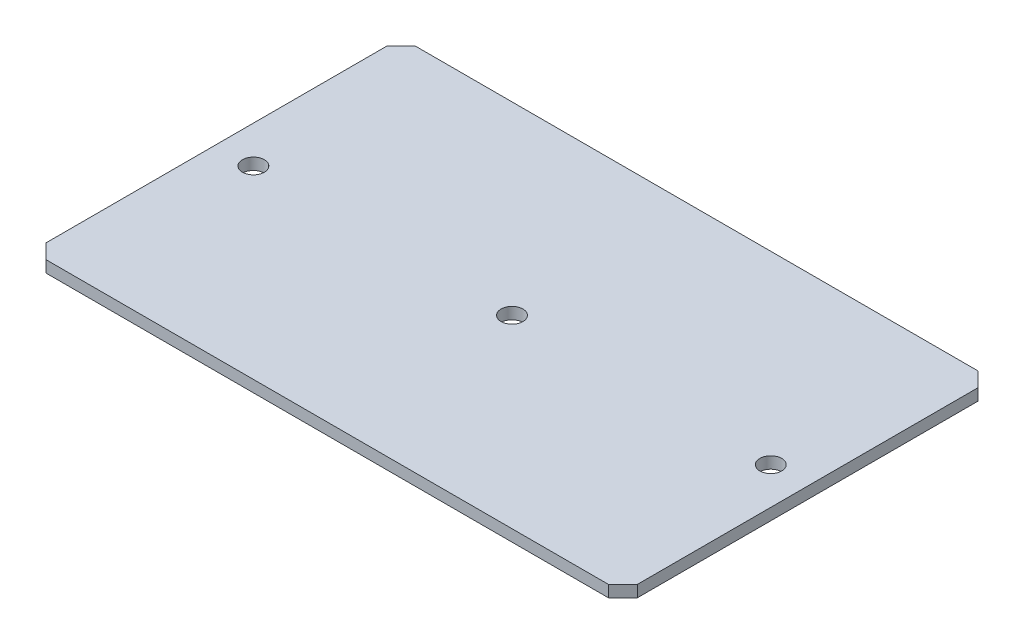
ISO-10303-21;
HEADER;
FILE_DESCRIPTION(('STEP AP214'),'2;1');
FILE_NAME('part.step','',(''),(''),'','','');
FILE_SCHEMA(('AUTOMOTIVE_DESIGN { 1 0 10303 214 1 1 1 1 }'));
ENDSEC;
DATA;
#1=APPLICATION_CONTEXT('core data for automotive mechanical design processes');
#2=APPLICATION_PROTOCOL_DEFINITION('international standard','automotive_design',2000,#1);
#3=PRODUCT_CONTEXT('',#1,'mechanical');
#4=PRODUCT('Part','Part','',(#3));
#5=PRODUCT_RELATED_PRODUCT_CATEGORY('part','',(#4));
#6=PRODUCT_DEFINITION_FORMATION('','',#4);
#7=PRODUCT_DEFINITION_CONTEXT('part definition',#1,'design');
#8=PRODUCT_DEFINITION('design','',#6,#7);
#9=PRODUCT_DEFINITION_SHAPE('','',#8);
#10=(LENGTH_UNIT() NAMED_UNIT(*) SI_UNIT(.MILLI.,.METRE.));
#11=(NAMED_UNIT(*) PLANE_ANGLE_UNIT() SI_UNIT($,.RADIAN.));
#12=(NAMED_UNIT(*) SI_UNIT($,.STERADIAN.) SOLID_ANGLE_UNIT());
#13=UNCERTAINTY_MEASURE_WITH_UNIT(LENGTH_MEASURE(1.E-05),#10,'distance_accuracy_value','');
#14=(GEOMETRIC_REPRESENTATION_CONTEXT(3) GLOBAL_UNCERTAINTY_ASSIGNED_CONTEXT((#13)) GLOBAL_UNIT_ASSIGNED_CONTEXT((#10,
#11,#12)) REPRESENTATION_CONTEXT('',''));
#15=CARTESIAN_POINT('',(0.,0.,0.));
#16=DIRECTION('',(0.,0.,1.));
#17=DIRECTION('',(1.,0.,0.));
#18=AXIS2_PLACEMENT_3D('',#15,#16,#17);
#19=CARTESIAN_POINT('',(40.64,1.6002,-25.4));
#20=DIRECTION('',(-1.,0.,0.));
#21=DIRECTION('',(0.,0.,1.));
#22=AXIS2_PLACEMENT_3D('',#19,#20,#21);
#23=PLANE('',#22);
#24=DIRECTION('',(0.,0.,-1.));
#25=VECTOR('',#24,1.);
#26=CARTESIAN_POINT('',(40.64,1.6002,-25.4));
#27=LINE('',#26,#25);
#28=CARTESIAN_POINT('',(40.64,1.6002,23.4));
#29=VERTEX_POINT('',#28);
#30=CARTESIAN_POINT('',(40.64,1.6002,-23.4));
#31=VERTEX_POINT('',#30);
#32=EDGE_CURVE('E133',#29,#31,#27,.T.);
#33=ORIENTED_EDGE('',*,*,#32,.F.);
#34=DIRECTION('',(0.,-1.,0.));
#35=VECTOR('',#34,1.);
#36=CARTESIAN_POINT('',(40.64,1.6002,23.4));
#37=LINE('',#36,#35);
#38=CARTESIAN_POINT('',(40.64,0.,23.4));
#39=VERTEX_POINT('',#38);
#40=EDGE_CURVE('E117',#29,#39,#37,.T.);
#41=ORIENTED_EDGE('',*,*,#40,.T.);
#42=DIRECTION('',(0.,0.,-1.));
#43=VECTOR('',#42,1.);
#44=CARTESIAN_POINT('',(40.64,0.,-25.4));
#45=LINE('',#44,#43);
#46=CARTESIAN_POINT('',(40.64,0.,-23.4));
#47=VERTEX_POINT('',#46);
#48=EDGE_CURVE('E130',#39,#47,#45,.T.);
#49=ORIENTED_EDGE('',*,*,#48,.T.);
#50=DIRECTION('',(0.,1.,0.));
#51=VECTOR('',#50,1.);
#52=CARTESIAN_POINT('',(40.64,1.6002,-23.4));
#53=LINE('',#52,#51);
#54=EDGE_CURVE('E136',#47,#31,#53,.T.);
#55=ORIENTED_EDGE('',*,*,#54,.T.);
#56=EDGE_LOOP('',(#33,#41,#49,#55));
#57=FACE_BOUND('',#56,.T.);
#58=ADVANCED_FACE('F45',(#57),#23,.F.);
#59=CARTESIAN_POINT('',(-40.64,1.6002,-25.4));
#60=DIRECTION('',(0.,0.,1.));
#61=DIRECTION('',(1.,0.,0.));
#62=AXIS2_PLACEMENT_3D('',#59,#60,#61);
#63=PLANE('',#62);
#64=DIRECTION('',(-1.,0.,0.));
#65=VECTOR('',#64,1.);
#66=CARTESIAN_POINT('',(-40.64,0.,-25.4));
#67=LINE('',#66,#65);
#68=CARTESIAN_POINT('',(38.64,0.,-25.4));
#69=VERTEX_POINT('',#68);
#70=CARTESIAN_POINT('',(-38.64,0.,-25.4));
#71=VERTEX_POINT('',#70);
#72=EDGE_CURVE('E141',#69,#71,#67,.T.);
#73=ORIENTED_EDGE('',*,*,#72,.T.);
#74=DIRECTION('',(0.,1.,0.));
#75=VECTOR('',#74,1.);
#76=CARTESIAN_POINT('',(-38.64,1.6002,-25.4));
#77=LINE('',#76,#75);
#78=CARTESIAN_POINT('',(-38.64,1.6002,-25.4));
#79=VERTEX_POINT('',#78);
#80=EDGE_CURVE('E11',#71,#79,#77,.T.);
#81=ORIENTED_EDGE('',*,*,#80,.T.);
#82=DIRECTION('',(-1.,0.,0.));
#83=VECTOR('',#82,1.);
#84=CARTESIAN_POINT('',(-40.64,1.6002,-25.4));
#85=LINE('',#84,#83);
#86=CARTESIAN_POINT('',(38.64,1.6002,-25.4));
#87=VERTEX_POINT('',#86);
#88=EDGE_CURVE('E198',#87,#79,#85,.T.);
#89=ORIENTED_EDGE('',*,*,#88,.F.);
#90=DIRECTION('',(0.,-1.,0.));
#91=VECTOR('',#90,1.);
#92=CARTESIAN_POINT('',(38.64,1.6002,-25.4));
#93=LINE('',#92,#91);
#94=EDGE_CURVE('E55',#87,#69,#93,.T.);
#95=ORIENTED_EDGE('',*,*,#94,.T.);
#96=EDGE_LOOP('',(#73,#81,#89,#95));
#97=FACE_BOUND('',#96,.T.);
#98=ADVANCED_FACE('F196',(#97),#63,.F.);
#99=CARTESIAN_POINT('',(-40.64,1.6002,-25.4));
#100=DIRECTION('',(1.,0.,0.));
#101=DIRECTION('',(0.,0.,-1.));
#102=AXIS2_PLACEMENT_3D('',#99,#100,#101);
#103=PLANE('',#102);
#104=DIRECTION('',(0.,0.,1.));
#105=VECTOR('',#104,1.);
#106=CARTESIAN_POINT('',(-40.64,0.,-25.4));
#107=LINE('',#106,#105);
#108=CARTESIAN_POINT('',(-40.64,0.,-23.4));
#109=VERTEX_POINT('',#108);
#110=CARTESIAN_POINT('',(-40.64,0.,23.4));
#111=VERTEX_POINT('',#110);
#112=EDGE_CURVE('E147',#109,#111,#107,.T.);
#113=ORIENTED_EDGE('',*,*,#112,.T.);
#114=DIRECTION('',(0.,1.,0.));
#115=VECTOR('',#114,1.);
#116=CARTESIAN_POINT('',(-40.64,1.6002,23.4));
#117=LINE('',#116,#115);
#118=CARTESIAN_POINT('',(-40.64,1.6002,23.4));
#119=VERTEX_POINT('',#118);
#120=EDGE_CURVE('E62',#111,#119,#117,.T.);
#121=ORIENTED_EDGE('',*,*,#120,.T.);
#122=DIRECTION('',(0.,0.,1.));
#123=VECTOR('',#122,1.);
#124=CARTESIAN_POINT('',(-40.64,1.6002,-25.4));
#125=LINE('',#124,#123);
#126=CARTESIAN_POINT('',(-40.64,1.6002,-23.4));
#127=VERTEX_POINT('',#126);
#128=EDGE_CURVE('E206',#127,#119,#125,.T.);
#129=ORIENTED_EDGE('',*,*,#128,.F.);
#130=DIRECTION('',(0.,-1.,0.));
#131=VECTOR('',#130,1.);
#132=CARTESIAN_POINT('',(-40.64,1.6002,-23.4));
#133=LINE('',#132,#131);
#134=EDGE_CURVE('E186',#127,#109,#133,.T.);
#135=ORIENTED_EDGE('',*,*,#134,.T.);
#136=EDGE_LOOP('',(#113,#121,#129,#135));
#137=FACE_BOUND('',#136,.T.);
#138=ADVANCED_FACE('F205',(#137),#103,.F.);
#139=CARTESIAN_POINT('',(-40.64,1.6002,25.4));
#140=DIRECTION('',(0.,0.,-1.));
#141=DIRECTION('',(-1.,0.,0.));
#142=AXIS2_PLACEMENT_3D('',#139,#140,#141);
#143=PLANE('',#142);
#144=DIRECTION('',(1.,0.,0.));
#145=VECTOR('',#144,1.);
#146=CARTESIAN_POINT('',(-40.64,0.,25.4));
#147=LINE('',#146,#145);
#148=CARTESIAN_POINT('',(-38.64,0.,25.4));
#149=VERTEX_POINT('',#148);
#150=CARTESIAN_POINT('',(38.64,0.,25.4));
#151=VERTEX_POINT('',#150);
#152=EDGE_CURVE('E158',#149,#151,#147,.T.);
#153=ORIENTED_EDGE('',*,*,#152,.T.);
#154=DIRECTION('',(0.,1.,0.));
#155=VECTOR('',#154,1.);
#156=CARTESIAN_POINT('',(38.64,1.6002,25.4));
#157=LINE('',#156,#155);
#158=CARTESIAN_POINT('',(38.64,1.6002,25.4));
#159=VERTEX_POINT('',#158);
#160=EDGE_CURVE('E118',#151,#159,#157,.T.);
#161=ORIENTED_EDGE('',*,*,#160,.T.);
#162=DIRECTION('',(1.,0.,0.));
#163=VECTOR('',#162,1.);
#164=CARTESIAN_POINT('',(-40.64,1.6002,25.4));
#165=LINE('',#164,#163);
#166=CARTESIAN_POINT('',(-38.64,1.6002,25.4));
#167=VERTEX_POINT('',#166);
#168=EDGE_CURVE('E153',#167,#159,#165,.T.);
#169=ORIENTED_EDGE('',*,*,#168,.F.);
#170=DIRECTION('',(0.,-1.,0.));
#171=VECTOR('',#170,1.);
#172=CARTESIAN_POINT('',(-38.64,1.6002,25.4));
#173=LINE('',#172,#171);
#174=EDGE_CURVE('E124',#167,#149,#173,.T.);
#175=ORIENTED_EDGE('',*,*,#174,.T.);
#176=EDGE_LOOP('',(#153,#161,#169,#175));
#177=FACE_BOUND('',#176,.T.);
#178=ADVANCED_FACE('F241',(#177),#143,.F.);
#179=CARTESIAN_POINT('',(0.,1.6002,0.));
#180=DIRECTION('',(0.,1.,0.));
#181=DIRECTION('',(0.,0.,1.));
#182=AXIS2_PLACEMENT_3D('',#179,#180,#181);
#183=PLANE('',#182);
#184=CARTESIAN_POINT('',(-35.54,1.6002,0.));
#185=DIRECTION('',(0.,1.,0.));
#186=DIRECTION('',(0.,0.,1.));
#187=AXIS2_PLACEMENT_3D('',#184,#185,#186);
#188=CIRCLE('',#187,1.5);
#189=CARTESIAN_POINT('',(-35.54,1.6002,1.5));
#190=VERTEX_POINT('',#189);
#191=EDGE_CURVE('E150',#190,#190,#188,.T.);
#192=ORIENTED_EDGE('',*,*,#191,.F.);
#193=EDGE_LOOP('',(#192));
#194=FACE_BOUND('',#193,.T.);
#195=CARTESIAN_POINT('',(35.56,1.6002,0.));
#196=DIRECTION('',(0.,1.,0.));
#197=DIRECTION('',(0.,0.,1.));
#198=AXIS2_PLACEMENT_3D('',#195,#196,#197);
#199=CIRCLE('',#198,1.5);
#200=CARTESIAN_POINT('',(35.56,1.6002,1.49999999999999));
#201=VERTEX_POINT('',#200);
#202=EDGE_CURVE('E228',#201,#201,#199,.T.);
#203=ORIENTED_EDGE('',*,*,#202,.F.);
#204=EDGE_LOOP('',(#203));
#205=FACE_BOUND('',#204,.T.);
#206=CARTESIAN_POINT('',(0.,1.6002,0.));
#207=DIRECTION('',(0.,1.,0.));
#208=DIRECTION('',(0.,0.,1.));
#209=AXIS2_PLACEMENT_3D('',#206,#207,#208);
#210=CIRCLE('',#209,1.5);
#211=CARTESIAN_POINT('',(0.,1.6002,1.5));
#212=VERTEX_POINT('',#211);
#213=EDGE_CURVE('E220',#212,#212,#210,.T.);
#214=ORIENTED_EDGE('',*,*,#213,.F.);
#215=EDGE_LOOP('',(#214));
#216=FACE_BOUND('',#215,.T.);
#217=ORIENTED_EDGE('',*,*,#168,.T.);
#218=DIRECTION('',(-0.707106781186549,0.,0.707106781186546));
#219=VECTOR('',#218,1.);
#220=CARTESIAN_POINT('',(32.0199999999999,1.6002,32.02));
#221=LINE('',#220,#219);
#222=EDGE_CURVE('E183',#159,#29,#221,.F.);
#223=ORIENTED_EDGE('',*,*,#222,.T.);
#224=ORIENTED_EDGE('',*,*,#32,.T.);
#225=DIRECTION('',(0.707106781186548,0.,0.707106781186548));
#226=VECTOR('',#225,1.);
#227=CARTESIAN_POINT('',(32.02,1.6002,-32.02));
#228=LINE('',#227,#226);
#229=EDGE_CURVE('E175',#31,#87,#228,.F.);
#230=ORIENTED_EDGE('',*,*,#229,.T.);
#231=ORIENTED_EDGE('',*,*,#88,.T.);
#232=DIRECTION('',(0.707106781186548,0.,-0.707106781186548));
#233=VECTOR('',#232,1.);
#234=CARTESIAN_POINT('',(-32.02,1.6002,-32.02));
#235=LINE('',#234,#233);
#236=EDGE_CURVE('E69',#79,#127,#235,.F.);
#237=ORIENTED_EDGE('',*,*,#236,.T.);
#238=ORIENTED_EDGE('',*,*,#128,.T.);
#239=DIRECTION('',(-0.707106781186545,0.,-0.70710678118655));
#240=VECTOR('',#239,1.);
#241=CARTESIAN_POINT('',(-32.0200000000001,1.6002,32.0199999999999));
#242=LINE('',#241,#240);
#243=EDGE_CURVE('E180',#119,#167,#242,.F.);
#244=ORIENTED_EDGE('',*,*,#243,.T.);
#245=EDGE_LOOP('',(#217,#223,#224,#230,#231,#237,#238,#244));
#246=FACE_BOUND('',#245,.T.);
#247=ADVANCED_FACE('F238',(#194,#205,#216,#246),#183,.T.);
#248=CARTESIAN_POINT('',(0.,0.,0.));
#249=DIRECTION('',(0.,1.,0.));
#250=DIRECTION('',(0.,0.,1.));
#251=AXIS2_PLACEMENT_3D('',#248,#249,#250);
#252=PLANE('',#251);
#253=CARTESIAN_POINT('',(-35.54,0.,0.));
#254=DIRECTION('',(0.,1.,0.));
#255=DIRECTION('',(0.,0.,1.));
#256=AXIS2_PLACEMENT_3D('',#253,#254,#255);
#257=CIRCLE('',#256,1.5);
#258=CARTESIAN_POINT('',(-35.54,0.,1.5));
#259=VERTEX_POINT('',#258);
#260=EDGE_CURVE('E142',#259,#259,#257,.T.);
#261=ORIENTED_EDGE('',*,*,#260,.T.);
#262=EDGE_LOOP('',(#261));
#263=FACE_BOUND('',#262,.T.);
#264=CARTESIAN_POINT('',(35.56,0.,0.));
#265=DIRECTION('',(0.,1.,0.));
#266=DIRECTION('',(0.,0.,1.));
#267=AXIS2_PLACEMENT_3D('',#264,#265,#266);
#268=CIRCLE('',#267,1.5);
#269=CARTESIAN_POINT('',(35.56,0.,1.49999999999999));
#270=VERTEX_POINT('',#269);
#271=EDGE_CURVE('E224',#270,#270,#268,.T.);
#272=ORIENTED_EDGE('',*,*,#271,.T.);
#273=EDGE_LOOP('',(#272));
#274=FACE_BOUND('',#273,.T.);
#275=CARTESIAN_POINT('',(0.,0.,0.));
#276=DIRECTION('',(0.,1.,0.));
#277=DIRECTION('',(0.,0.,1.));
#278=AXIS2_PLACEMENT_3D('',#275,#276,#277);
#279=CIRCLE('',#278,1.5);
#280=CARTESIAN_POINT('',(0.,0.,1.5));
#281=VERTEX_POINT('',#280);
#282=EDGE_CURVE('E216',#281,#281,#279,.T.);
#283=ORIENTED_EDGE('',*,*,#282,.T.);
#284=EDGE_LOOP('',(#283));
#285=FACE_BOUND('',#284,.T.);
#286=ORIENTED_EDGE('',*,*,#48,.F.);
#287=DIRECTION('',(0.707106781186549,0.,-0.707106781186546));
#288=VECTOR('',#287,1.);
#289=CARTESIAN_POINT('',(40.64,0.,23.4));
#290=LINE('',#289,#288);
#291=EDGE_CURVE('E113',#39,#151,#290,.F.);
#292=ORIENTED_EDGE('',*,*,#291,.T.);
#293=ORIENTED_EDGE('',*,*,#152,.F.);
#294=DIRECTION('',(0.707106781186545,0.,0.70710678118655));
#295=VECTOR('',#294,1.);
#296=CARTESIAN_POINT('',(-38.64,0.,25.4));
#297=LINE('',#296,#295);
#298=EDGE_CURVE('E125',#149,#111,#297,.F.);
#299=ORIENTED_EDGE('',*,*,#298,.T.);
#300=ORIENTED_EDGE('',*,*,#112,.F.);
#301=DIRECTION('',(-0.707106781186548,0.,0.707106781186548));
#302=VECTOR('',#301,1.);
#303=CARTESIAN_POINT('',(-40.64,0.,-23.4));
#304=LINE('',#303,#302);
#305=EDGE_CURVE('E165',#109,#71,#304,.F.);
#306=ORIENTED_EDGE('',*,*,#305,.T.);
#307=ORIENTED_EDGE('',*,*,#72,.F.);
#308=DIRECTION('',(-0.707106781186548,0.,-0.707106781186548));
#309=VECTOR('',#308,1.);
#310=CARTESIAN_POINT('',(38.64,0.,-25.4));
#311=LINE('',#310,#309);
#312=EDGE_CURVE('E135',#69,#47,#311,.F.);
#313=ORIENTED_EDGE('',*,*,#312,.T.);
#314=EDGE_LOOP('',(#286,#292,#293,#299,#300,#306,#307,#313));
#315=FACE_BOUND('',#314,.T.);
#316=ADVANCED_FACE('F138',(#263,#274,#285,#315),#252,.F.);
#317=CARTESIAN_POINT('',(0.,0.,0.));
#318=DIRECTION('',(0.,1.,0.));
#319=DIRECTION('',(0.,0.,1.));
#320=AXIS2_PLACEMENT_3D('',#317,#318,#319);
#321=CYLINDRICAL_SURFACE('',#320,1.5);
#322=ORIENTED_EDGE('',*,*,#282,.F.);
#323=EDGE_LOOP('',(#322));
#324=FACE_BOUND('',#323,.T.);
#325=ORIENTED_EDGE('',*,*,#213,.T.);
#326=EDGE_LOOP('',(#325));
#327=FACE_BOUND('',#326,.T.);
#328=ADVANCED_FACE('F281',(#324,#327),#321,.F.);
#329=CARTESIAN_POINT('',(35.56,0.,0.));
#330=DIRECTION('',(0.,1.,0.));
#331=DIRECTION('',(0.,0.,1.));
#332=AXIS2_PLACEMENT_3D('',#329,#330,#331);
#333=CYLINDRICAL_SURFACE('',#332,1.5);
#334=ORIENTED_EDGE('',*,*,#271,.F.);
#335=EDGE_LOOP('',(#334));
#336=FACE_BOUND('',#335,.T.);
#337=ORIENTED_EDGE('',*,*,#202,.T.);
#338=EDGE_LOOP('',(#337));
#339=FACE_BOUND('',#338,.T.);
#340=ADVANCED_FACE('F286',(#336,#339),#333,.F.);
#341=CARTESIAN_POINT('',(-35.54,0.,0.));
#342=DIRECTION('',(0.,1.,0.));
#343=DIRECTION('',(0.,0.,1.));
#344=AXIS2_PLACEMENT_3D('',#341,#342,#343);
#345=CYLINDRICAL_SURFACE('',#344,1.5);
#346=ORIENTED_EDGE('',*,*,#260,.F.);
#347=EDGE_LOOP('',(#346));
#348=FACE_BOUND('',#347,.T.);
#349=ORIENTED_EDGE('',*,*,#191,.T.);
#350=EDGE_LOOP('',(#349));
#351=FACE_BOUND('',#350,.T.);
#352=ADVANCED_FACE('F236',(#348,#351),#345,.F.);
#353=CARTESIAN_POINT('',(40.64,1.6002,23.4));
#354=DIRECTION('',(-0.707106781186546,0.,-0.707106781186549));
#355=DIRECTION('',(0.,-1.,0.));
#356=AXIS2_PLACEMENT_3D('',#353,#354,#355);
#357=PLANE('',#356);
#358=ORIENTED_EDGE('',*,*,#222,.F.);
#359=ORIENTED_EDGE('',*,*,#160,.F.);
#360=ORIENTED_EDGE('',*,*,#291,.F.);
#361=ORIENTED_EDGE('',*,*,#40,.F.);
#362=EDGE_LOOP('',(#358,#359,#360,#361));
#363=FACE_BOUND('',#362,.T.);
#364=ADVANCED_FACE('F116',(#363),#357,.F.);
#365=CARTESIAN_POINT('',(-38.64,1.6002,25.4));
#366=DIRECTION('',(0.70710678118655,0.,-0.707106781186545));
#367=DIRECTION('',(0.,-1.,0.));
#368=AXIS2_PLACEMENT_3D('',#365,#366,#367);
#369=PLANE('',#368);
#370=ORIENTED_EDGE('',*,*,#243,.F.);
#371=ORIENTED_EDGE('',*,*,#120,.F.);
#372=ORIENTED_EDGE('',*,*,#298,.F.);
#373=ORIENTED_EDGE('',*,*,#174,.F.);
#374=EDGE_LOOP('',(#370,#371,#372,#373));
#375=FACE_BOUND('',#374,.T.);
#376=ADVANCED_FACE('F250',(#375),#369,.F.);
#377=CARTESIAN_POINT('',(-40.64,1.6002,-23.4));
#378=DIRECTION('',(0.707106781186547,0.,0.707106781186547));
#379=DIRECTION('',(0.,-1.,0.));
#380=AXIS2_PLACEMENT_3D('',#377,#378,#379);
#381=PLANE('',#380);
#382=ORIENTED_EDGE('',*,*,#236,.F.);
#383=ORIENTED_EDGE('',*,*,#80,.F.);
#384=ORIENTED_EDGE('',*,*,#305,.F.);
#385=ORIENTED_EDGE('',*,*,#134,.F.);
#386=EDGE_LOOP('',(#382,#383,#384,#385));
#387=FACE_BOUND('',#386,.T.);
#388=ADVANCED_FACE('F204',(#387),#381,.F.);
#389=CARTESIAN_POINT('',(38.64,1.6002,-25.4));
#390=DIRECTION('',(-0.707106781186547,0.,0.707106781186547));
#391=DIRECTION('',(0.,-1.,0.));
#392=AXIS2_PLACEMENT_3D('',#389,#390,#391);
#393=PLANE('',#392);
#394=ORIENTED_EDGE('',*,*,#229,.F.);
#395=ORIENTED_EDGE('',*,*,#54,.F.);
#396=ORIENTED_EDGE('',*,*,#312,.F.);
#397=ORIENTED_EDGE('',*,*,#94,.F.);
#398=EDGE_LOOP('',(#394,#395,#396,#397));
#399=FACE_BOUND('',#398,.T.);
#400=ADVANCED_FACE('F48',(#399),#393,.F.);
#401=CLOSED_SHELL('',(#58,#98,#138,#178,#247,#316,#328,#340,#352,#364,#376,#388,#400));
#402=MANIFOLD_SOLID_BREP('B2',#401);
#403=ADVANCED_BREP_SHAPE_REPRESENTATION('',(#18,#402),#14);
#404=SHAPE_DEFINITION_REPRESENTATION(#9,#403);
ENDSEC;
END-ISO-10303-21;
